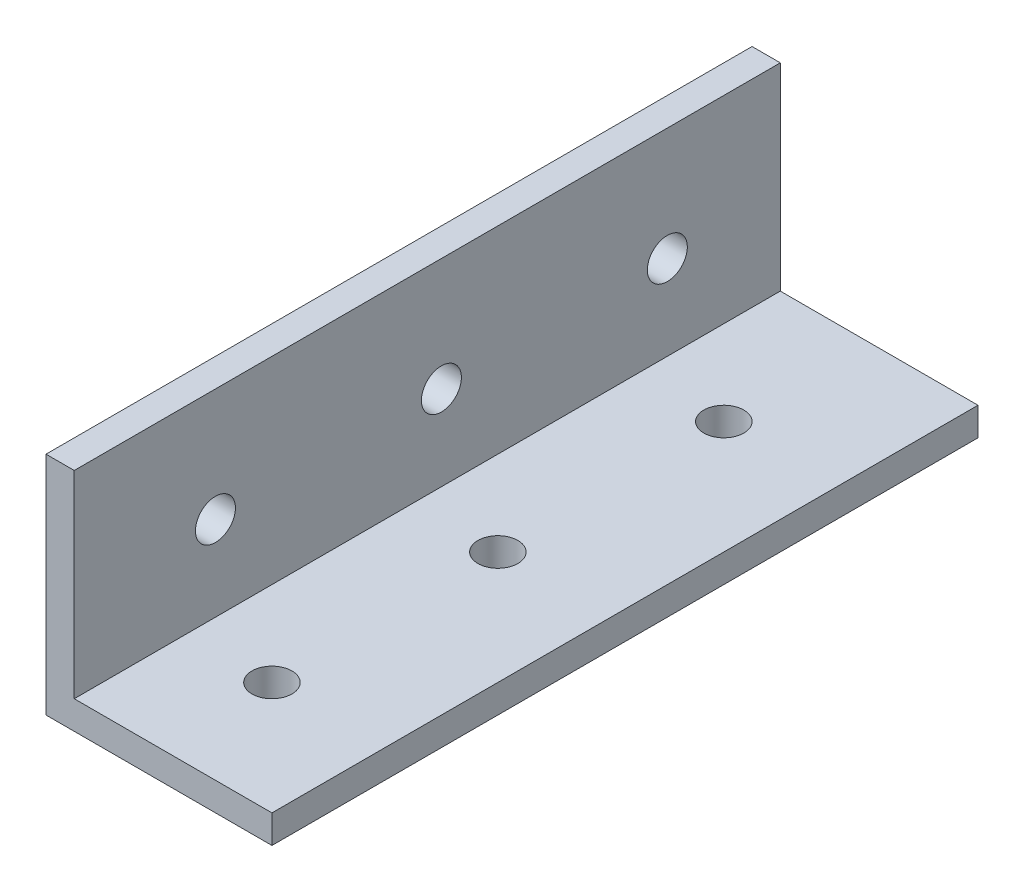
ISO-10303-21;
HEADER;
FILE_DESCRIPTION(('STEP AP214'),'2;1');
FILE_NAME('part.step','',(''),(''),'','','');
FILE_SCHEMA(('AUTOMOTIVE_DESIGN { 1 0 10303 214 1 1 1 1 }'));
ENDSEC;
DATA;
#1=APPLICATION_CONTEXT('core data for automotive mechanical design processes');
#2=APPLICATION_PROTOCOL_DEFINITION('international standard','automotive_design',2000,#1);
#3=PRODUCT_CONTEXT('',#1,'mechanical');
#4=PRODUCT('Part','Part','',(#3));
#5=PRODUCT_RELATED_PRODUCT_CATEGORY('part','',(#4));
#6=PRODUCT_DEFINITION_FORMATION('','',#4);
#7=PRODUCT_DEFINITION_CONTEXT('part definition',#1,'design');
#8=PRODUCT_DEFINITION('design','',#6,#7);
#9=PRODUCT_DEFINITION_SHAPE('','',#8);
#10=(LENGTH_UNIT() NAMED_UNIT(*) SI_UNIT(.MILLI.,.METRE.));
#11=(NAMED_UNIT(*) PLANE_ANGLE_UNIT() SI_UNIT($,.RADIAN.));
#12=(NAMED_UNIT(*) SI_UNIT($,.STERADIAN.) SOLID_ANGLE_UNIT());
#13=UNCERTAINTY_MEASURE_WITH_UNIT(LENGTH_MEASURE(1.E-05),#10,'distance_accuracy_value','');
#14=(GEOMETRIC_REPRESENTATION_CONTEXT(3) GLOBAL_UNCERTAINTY_ASSIGNED_CONTEXT((#13)) GLOBAL_UNIT_ASSIGNED_CONTEXT((#10,
#11,#12)) REPRESENTATION_CONTEXT('',''));
#15=CARTESIAN_POINT('',(0.,0.,0.));
#16=DIRECTION('',(0.,0.,1.));
#17=DIRECTION('',(1.,0.,0.));
#18=AXIS2_PLACEMENT_3D('',#15,#16,#17);
#19=CARTESIAN_POINT('',(0.,0.,79.375));
#20=DIRECTION('',(1.,0.,0.));
#21=DIRECTION('',(0.,0.,-1.));
#22=AXIS2_PLACEMENT_3D('',#19,#20,#21);
#23=PLANE('',#22);
#24=CARTESIAN_POINT('',(0.,12.7,63.5));
#25=DIRECTION('',(-1.,0.,0.));
#26=DIRECTION('',(0.,0.,1.));
#27=AXIS2_PLACEMENT_3D('',#24,#25,#26);
#28=CIRCLE('',#27,2.24789999999999);
#29=CARTESIAN_POINT('',(0.,12.7,65.7479));
#30=VERTEX_POINT('',#29);
#31=EDGE_CURVE('E186',#30,#30,#28,.T.);
#32=ORIENTED_EDGE('',*,*,#31,.F.);
#33=EDGE_LOOP('',(#32));
#34=FACE_BOUND('',#33,.T.);
#35=CARTESIAN_POINT('',(0.,12.7,38.1));
#36=DIRECTION('',(-1.,0.,0.));
#37=DIRECTION('',(0.,0.,1.));
#38=AXIS2_PLACEMENT_3D('',#35,#36,#37);
#39=CIRCLE('',#38,2.24789999999999);
#40=CARTESIAN_POINT('',(0.,12.7,40.3479));
#41=VERTEX_POINT('',#40);
#42=EDGE_CURVE('E190',#41,#41,#39,.T.);
#43=ORIENTED_EDGE('',*,*,#42,.F.);
#44=EDGE_LOOP('',(#43));
#45=FACE_BOUND('',#44,.T.);
#46=CARTESIAN_POINT('',(0.,12.7,12.7));
#47=DIRECTION('',(-1.,0.,0.));
#48=DIRECTION('',(0.,0.,1.));
#49=AXIS2_PLACEMENT_3D('',#46,#47,#48);
#50=CIRCLE('',#49,2.24789999999999);
#51=CARTESIAN_POINT('',(0.,12.7,14.9479));
#52=VERTEX_POINT('',#51);
#53=EDGE_CURVE('E193',#52,#52,#50,.T.);
#54=ORIENTED_EDGE('',*,*,#53,.F.);
#55=EDGE_LOOP('',(#54));
#56=FACE_BOUND('',#55,.T.);
#57=DIRECTION('',(0.,-1.,0.));
#58=VECTOR('',#57,1.);
#59=CARTESIAN_POINT('',(0.,0.,0.));
#60=LINE('',#59,#58);
#61=CARTESIAN_POINT('',(0.,25.4,0.));
#62=VERTEX_POINT('',#61);
#63=CARTESIAN_POINT('',(0.,0.,0.));
#64=VERTEX_POINT('',#63);
#65=EDGE_CURVE('E119',#62,#64,#60,.T.);
#66=ORIENTED_EDGE('',*,*,#65,.T.);
#67=DIRECTION('',(0.,0.,-1.));
#68=VECTOR('',#67,1.);
#69=CARTESIAN_POINT('',(0.,0.,79.375));
#70=LINE('',#69,#68);
#71=CARTESIAN_POINT('',(0.,0.,79.375));
#72=VERTEX_POINT('',#71);
#73=EDGE_CURVE('E11',#72,#64,#70,.T.);
#74=ORIENTED_EDGE('',*,*,#73,.F.);
#75=DIRECTION('',(0.,-1.,0.));
#76=VECTOR('',#75,1.);
#77=CARTESIAN_POINT('',(0.,0.,79.375));
#78=LINE('',#77,#76);
#79=CARTESIAN_POINT('',(0.,25.4,79.375));
#80=VERTEX_POINT('',#79);
#81=EDGE_CURVE('E130',#80,#72,#78,.T.);
#82=ORIENTED_EDGE('',*,*,#81,.F.);
#83=DIRECTION('',(0.,0.,-1.));
#84=VECTOR('',#83,1.);
#85=CARTESIAN_POINT('',(0.,25.4,79.375));
#86=LINE('',#85,#84);
#87=EDGE_CURVE('E115',#80,#62,#86,.T.);
#88=ORIENTED_EDGE('',*,*,#87,.T.);
#89=EDGE_LOOP('',(#66,#74,#82,#88));
#90=FACE_BOUND('',#89,.T.);
#91=ADVANCED_FACE('F33',(#34,#45,#56,#90),#23,.F.);
#92=CARTESIAN_POINT('',(0.,0.,79.375));
#93=DIRECTION('',(0.,1.,0.));
#94=DIRECTION('',(0.,0.,1.));
#95=AXIS2_PLACEMENT_3D('',#92,#93,#94);
#96=PLANE('',#95);
#97=CARTESIAN_POINT('',(12.7,0.,66.675));
#98=DIRECTION('',(0.,-1.,0.));
#99=DIRECTION('',(0.,0.,-1.));
#100=AXIS2_PLACEMENT_3D('',#97,#98,#99);
#101=CIRCLE('',#100,2.24789999999999);
#102=CARTESIAN_POINT('',(12.7,0.,64.4271));
#103=VERTEX_POINT('',#102);
#104=EDGE_CURVE('E149',#103,#103,#101,.T.);
#105=ORIENTED_EDGE('',*,*,#104,.F.);
#106=EDGE_LOOP('',(#105));
#107=FACE_BOUND('',#106,.T.);
#108=CARTESIAN_POINT('',(12.7,0.,41.275));
#109=DIRECTION('',(0.,-1.,0.));
#110=DIRECTION('',(0.,0.,-1.));
#111=AXIS2_PLACEMENT_3D('',#108,#109,#110);
#112=CIRCLE('',#111,2.24789999999999);
#113=CARTESIAN_POINT('',(12.7,0.,39.0271));
#114=VERTEX_POINT('',#113);
#115=EDGE_CURVE('E138',#114,#114,#112,.T.);
#116=ORIENTED_EDGE('',*,*,#115,.F.);
#117=EDGE_LOOP('',(#116));
#118=FACE_BOUND('',#117,.T.);
#119=CARTESIAN_POINT('',(12.7,0.,15.875));
#120=DIRECTION('',(0.,-1.,0.));
#121=DIRECTION('',(0.,0.,-1.));
#122=AXIS2_PLACEMENT_3D('',#119,#120,#121);
#123=CIRCLE('',#122,2.24789999999999);
#124=CARTESIAN_POINT('',(12.7,0.,13.6271));
#125=VERTEX_POINT('',#124);
#126=EDGE_CURVE('E137',#125,#125,#123,.T.);
#127=ORIENTED_EDGE('',*,*,#126,.F.);
#128=EDGE_LOOP('',(#127));
#129=FACE_BOUND('',#128,.T.);
#130=DIRECTION('',(1.,0.,0.));
#131=VECTOR('',#130,1.);
#132=CARTESIAN_POINT('',(0.,0.,0.));
#133=LINE('',#132,#131);
#134=CARTESIAN_POINT('',(25.4,0.,0.));
#135=VERTEX_POINT('',#134);
#136=EDGE_CURVE('E122',#64,#135,#133,.T.);
#137=ORIENTED_EDGE('',*,*,#136,.T.);
#138=DIRECTION('',(0.,0.,-1.));
#139=VECTOR('',#138,1.);
#140=CARTESIAN_POINT('',(25.4,0.,79.375));
#141=LINE('',#140,#139);
#142=CARTESIAN_POINT('',(25.4,0.,79.375));
#143=VERTEX_POINT('',#142);
#144=EDGE_CURVE('E42',#143,#135,#141,.T.);
#145=ORIENTED_EDGE('',*,*,#144,.F.);
#146=DIRECTION('',(1.,0.,0.));
#147=VECTOR('',#146,1.);
#148=CARTESIAN_POINT('',(0.,0.,79.375));
#149=LINE('',#148,#147);
#150=EDGE_CURVE('E88',#72,#143,#149,.T.);
#151=ORIENTED_EDGE('',*,*,#150,.F.);
#152=ORIENTED_EDGE('',*,*,#73,.T.);
#153=EDGE_LOOP('',(#137,#145,#151,#152));
#154=FACE_BOUND('',#153,.T.);
#155=ADVANCED_FACE('F158',(#107,#118,#129,#154),#96,.F.);
#156=CARTESIAN_POINT('',(25.4,0.,79.375));
#157=DIRECTION('',(-1.,0.,0.));
#158=DIRECTION('',(0.,0.,1.));
#159=AXIS2_PLACEMENT_3D('',#156,#157,#158);
#160=PLANE('',#159);
#161=DIRECTION('',(0.,1.,0.));
#162=VECTOR('',#161,1.);
#163=CARTESIAN_POINT('',(25.4,0.,0.));
#164=LINE('',#163,#162);
#165=CARTESIAN_POINT('',(25.4,3.175,0.));
#166=VERTEX_POINT('',#165);
#167=EDGE_CURVE('E125',#135,#166,#164,.T.);
#168=ORIENTED_EDGE('',*,*,#167,.T.);
#169=DIRECTION('',(0.,0.,-1.));
#170=VECTOR('',#169,1.);
#171=CARTESIAN_POINT('',(25.4,3.175,79.375));
#172=LINE('',#171,#170);
#173=CARTESIAN_POINT('',(25.4,3.175,79.375));
#174=VERTEX_POINT('',#173);
#175=EDGE_CURVE('E110',#174,#166,#172,.T.);
#176=ORIENTED_EDGE('',*,*,#175,.F.);
#177=DIRECTION('',(0.,1.,0.));
#178=VECTOR('',#177,1.);
#179=CARTESIAN_POINT('',(25.4,0.,79.375));
#180=LINE('',#179,#178);
#181=EDGE_CURVE('E101',#143,#174,#180,.T.);
#182=ORIENTED_EDGE('',*,*,#181,.F.);
#183=ORIENTED_EDGE('',*,*,#144,.T.);
#184=EDGE_LOOP('',(#168,#176,#182,#183));
#185=FACE_BOUND('',#184,.T.);
#186=ADVANCED_FACE('F161',(#185),#160,.F.);
#187=CARTESIAN_POINT('',(25.4,3.175,79.375));
#188=DIRECTION('',(0.,-1.,0.));
#189=DIRECTION('',(1.,0.,0.));
#190=AXIS2_PLACEMENT_3D('',#187,#188,#189);
#191=PLANE('',#190);
#192=CARTESIAN_POINT('',(12.7,3.175,66.675));
#193=DIRECTION('',(0.,-1.,0.));
#194=DIRECTION('',(1.,0.,0.));
#195=AXIS2_PLACEMENT_3D('',#192,#193,#194);
#196=CIRCLE('',#195,2.24789999999999);
#197=CARTESIAN_POINT('',(14.9479,3.175,66.675));
#198=VERTEX_POINT('',#197);
#199=EDGE_CURVE('E144',#198,#198,#196,.T.);
#200=ORIENTED_EDGE('',*,*,#199,.T.);
#201=EDGE_LOOP('',(#200));
#202=FACE_BOUND('',#201,.T.);
#203=CARTESIAN_POINT('',(12.7,3.175,41.275));
#204=DIRECTION('',(0.,-1.,0.));
#205=DIRECTION('',(1.,0.,0.));
#206=AXIS2_PLACEMENT_3D('',#203,#204,#205);
#207=CIRCLE('',#206,2.24789999999999);
#208=CARTESIAN_POINT('',(14.9479,3.175,41.275));
#209=VERTEX_POINT('',#208);
#210=EDGE_CURVE('E135',#209,#209,#207,.T.);
#211=ORIENTED_EDGE('',*,*,#210,.T.);
#212=EDGE_LOOP('',(#211));
#213=FACE_BOUND('',#212,.T.);
#214=CARTESIAN_POINT('',(12.7,3.175,15.875));
#215=DIRECTION('',(0.,-1.,0.));
#216=DIRECTION('',(1.,0.,0.));
#217=AXIS2_PLACEMENT_3D('',#214,#215,#216);
#218=CIRCLE('',#217,2.24789999999999);
#219=CARTESIAN_POINT('',(14.9479,3.175,15.875));
#220=VERTEX_POINT('',#219);
#221=EDGE_CURVE('E123',#220,#220,#218,.T.);
#222=ORIENTED_EDGE('',*,*,#221,.T.);
#223=EDGE_LOOP('',(#222));
#224=FACE_BOUND('',#223,.T.);
#225=DIRECTION('',(-1.,0.,0.));
#226=VECTOR('',#225,1.);
#227=CARTESIAN_POINT('',(25.4,3.175,0.));
#228=LINE('',#227,#226);
#229=CARTESIAN_POINT('',(3.175,3.175,0.));
#230=VERTEX_POINT('',#229);
#231=EDGE_CURVE('E109',#166,#230,#228,.T.);
#232=ORIENTED_EDGE('',*,*,#231,.T.);
#233=DIRECTION('',(0.,0.,-1.));
#234=VECTOR('',#233,1.);
#235=CARTESIAN_POINT('',(3.175,3.175,79.375));
#236=LINE('',#235,#234);
#237=CARTESIAN_POINT('',(3.175,3.175,79.375));
#238=VERTEX_POINT('',#237);
#239=EDGE_CURVE('E106',#238,#230,#236,.T.);
#240=ORIENTED_EDGE('',*,*,#239,.F.);
#241=DIRECTION('',(-1.,0.,0.));
#242=VECTOR('',#241,1.);
#243=CARTESIAN_POINT('',(25.4,3.175,79.375));
#244=LINE('',#243,#242);
#245=EDGE_CURVE('E95',#174,#238,#244,.T.);
#246=ORIENTED_EDGE('',*,*,#245,.F.);
#247=ORIENTED_EDGE('',*,*,#175,.T.);
#248=EDGE_LOOP('',(#232,#240,#246,#247));
#249=FACE_BOUND('',#248,.T.);
#250=ADVANCED_FACE('F107',(#202,#213,#224,#249),#191,.F.);
#251=CARTESIAN_POINT('',(3.175,25.4,79.375));
#252=DIRECTION('',(-1.,0.,0.));
#253=DIRECTION('',(0.,-1.,0.));
#254=AXIS2_PLACEMENT_3D('',#251,#252,#253);
#255=PLANE('',#254);
#256=CARTESIAN_POINT('',(3.175,12.7,63.5));
#257=DIRECTION('',(-1.,0.,0.));
#258=DIRECTION('',(0.,-1.,0.));
#259=AXIS2_PLACEMENT_3D('',#256,#257,#258);
#260=CIRCLE('',#259,2.24789999999999);
#261=CARTESIAN_POINT('',(3.175,10.4521,63.5));
#262=VERTEX_POINT('',#261);
#263=EDGE_CURVE('E299',#262,#262,#260,.T.);
#264=ORIENTED_EDGE('',*,*,#263,.T.);
#265=EDGE_LOOP('',(#264));
#266=FACE_BOUND('',#265,.T.);
#267=CARTESIAN_POINT('',(3.175,12.7,38.1));
#268=DIRECTION('',(-1.,0.,0.));
#269=DIRECTION('',(0.,-1.,0.));
#270=AXIS2_PLACEMENT_3D('',#267,#268,#269);
#271=CIRCLE('',#270,2.24789999999999);
#272=CARTESIAN_POINT('',(3.175,10.4521,38.1));
#273=VERTEX_POINT('',#272);
#274=EDGE_CURVE('E36',#273,#273,#271,.T.);
#275=ORIENTED_EDGE('',*,*,#274,.T.);
#276=EDGE_LOOP('',(#275));
#277=FACE_BOUND('',#276,.T.);
#278=CARTESIAN_POINT('',(3.175,12.7,12.7));
#279=DIRECTION('',(-1.,0.,0.));
#280=DIRECTION('',(0.,-1.,0.));
#281=AXIS2_PLACEMENT_3D('',#278,#279,#280);
#282=CIRCLE('',#281,2.24789999999999);
#283=CARTESIAN_POINT('',(3.175,10.4521,12.7));
#284=VERTEX_POINT('',#283);
#285=EDGE_CURVE('E195',#284,#284,#282,.T.);
#286=ORIENTED_EDGE('',*,*,#285,.T.);
#287=EDGE_LOOP('',(#286));
#288=FACE_BOUND('',#287,.T.);
#289=DIRECTION('',(0.,1.,0.));
#290=VECTOR('',#289,1.);
#291=CARTESIAN_POINT('',(3.175,25.4,0.));
#292=LINE('',#291,#290);
#293=CARTESIAN_POINT('',(3.175,25.4,0.));
#294=VERTEX_POINT('',#293);
#295=EDGE_CURVE('E74',#230,#294,#292,.T.);
#296=ORIENTED_EDGE('',*,*,#295,.T.);
#297=DIRECTION('',(0.,0.,-1.));
#298=VECTOR('',#297,1.);
#299=CARTESIAN_POINT('',(3.175,25.4,79.375));
#300=LINE('',#299,#298);
#301=CARTESIAN_POINT('',(3.175,25.4,79.375));
#302=VERTEX_POINT('',#301);
#303=EDGE_CURVE('E111',#302,#294,#300,.T.);
#304=ORIENTED_EDGE('',*,*,#303,.F.);
#305=DIRECTION('',(0.,1.,0.));
#306=VECTOR('',#305,1.);
#307=CARTESIAN_POINT('',(3.175,25.4,79.375));
#308=LINE('',#307,#306);
#309=EDGE_CURVE('E99',#238,#302,#308,.T.);
#310=ORIENTED_EDGE('',*,*,#309,.F.);
#311=ORIENTED_EDGE('',*,*,#239,.T.);
#312=EDGE_LOOP('',(#296,#304,#310,#311));
#313=FACE_BOUND('',#312,.T.);
#314=ADVANCED_FACE('F113',(#266,#277,#288,#313),#255,.F.);
#315=CARTESIAN_POINT('',(0.,25.4,79.375));
#316=DIRECTION('',(0.,-1.,0.));
#317=DIRECTION('',(0.,0.,-1.));
#318=AXIS2_PLACEMENT_3D('',#315,#316,#317);
#319=PLANE('',#318);
#320=DIRECTION('',(-1.,0.,0.));
#321=VECTOR('',#320,1.);
#322=CARTESIAN_POINT('',(0.,25.4,0.));
#323=LINE('',#322,#321);
#324=EDGE_CURVE('E80',#294,#62,#323,.T.);
#325=ORIENTED_EDGE('',*,*,#324,.T.);
#326=ORIENTED_EDGE('',*,*,#87,.F.);
#327=DIRECTION('',(-1.,0.,0.));
#328=VECTOR('',#327,1.);
#329=CARTESIAN_POINT('',(0.,25.4,79.375));
#330=LINE('',#329,#328);
#331=EDGE_CURVE('E51',#302,#80,#330,.T.);
#332=ORIENTED_EDGE('',*,*,#331,.F.);
#333=ORIENTED_EDGE('',*,*,#303,.T.);
#334=EDGE_LOOP('',(#325,#326,#332,#333));
#335=FACE_BOUND('',#334,.T.);
#336=ADVANCED_FACE('F166',(#335),#319,.F.);
#337=CARTESIAN_POINT('',(0.,0.,79.375));
#338=DIRECTION('',(0.,0.,-1.));
#339=DIRECTION('',(-1.,0.,0.));
#340=AXIS2_PLACEMENT_3D('',#337,#338,#339);
#341=PLANE('',#340);
#342=ORIENTED_EDGE('',*,*,#81,.T.);
#343=ORIENTED_EDGE('',*,*,#150,.T.);
#344=ORIENTED_EDGE('',*,*,#181,.T.);
#345=ORIENTED_EDGE('',*,*,#245,.T.);
#346=ORIENTED_EDGE('',*,*,#309,.T.);
#347=ORIENTED_EDGE('',*,*,#331,.T.);
#348=EDGE_LOOP('',(#342,#343,#344,#345,#346,#347));
#349=FACE_BOUND('',#348,.T.);
#350=ADVANCED_FACE('F97',(#349),#341,.F.);
#351=CARTESIAN_POINT('',(0.,0.,0.));
#352=DIRECTION('',(0.,0.,-1.));
#353=DIRECTION('',(-1.,0.,0.));
#354=AXIS2_PLACEMENT_3D('',#351,#352,#353);
#355=PLANE('',#354);
#356=ORIENTED_EDGE('',*,*,#65,.F.);
#357=ORIENTED_EDGE('',*,*,#324,.F.);
#358=ORIENTED_EDGE('',*,*,#295,.F.);
#359=ORIENTED_EDGE('',*,*,#231,.F.);
#360=ORIENTED_EDGE('',*,*,#167,.F.);
#361=ORIENTED_EDGE('',*,*,#136,.F.);
#362=EDGE_LOOP('',(#356,#357,#358,#359,#360,#361));
#363=FACE_BOUND('',#362,.T.);
#364=ADVANCED_FACE('F164',(#363),#355,.T.);
#365=CARTESIAN_POINT('',(12.7,0.,15.875));
#366=DIRECTION('',(0.,-1.,0.));
#367=DIRECTION('',(0.,0.,-1.));
#368=AXIS2_PLACEMENT_3D('',#365,#366,#367);
#369=CYLINDRICAL_SURFACE('',#368,2.24789999999999);
#370=ORIENTED_EDGE('',*,*,#126,.T.);
#371=EDGE_LOOP('',(#370));
#372=FACE_BOUND('',#371,.T.);
#373=ORIENTED_EDGE('',*,*,#221,.F.);
#374=EDGE_LOOP('',(#373));
#375=FACE_BOUND('',#374,.T.);
#376=ADVANCED_FACE('F211',(#372,#375),#369,.F.);
#377=CARTESIAN_POINT('',(12.7,0.,41.275));
#378=DIRECTION('',(0.,-1.,0.));
#379=DIRECTION('',(0.,0.,-1.));
#380=AXIS2_PLACEMENT_3D('',#377,#378,#379);
#381=CYLINDRICAL_SURFACE('',#380,2.24789999999999);
#382=ORIENTED_EDGE('',*,*,#115,.T.);
#383=EDGE_LOOP('',(#382));
#384=FACE_BOUND('',#383,.T.);
#385=ORIENTED_EDGE('',*,*,#210,.F.);
#386=EDGE_LOOP('',(#385));
#387=FACE_BOUND('',#386,.T.);
#388=ADVANCED_FACE('F214',(#384,#387),#381,.F.);
#389=CARTESIAN_POINT('',(12.7,0.,66.675));
#390=DIRECTION('',(0.,-1.,0.));
#391=DIRECTION('',(0.,0.,-1.));
#392=AXIS2_PLACEMENT_3D('',#389,#390,#391);
#393=CYLINDRICAL_SURFACE('',#392,2.24789999999999);
#394=ORIENTED_EDGE('',*,*,#104,.T.);
#395=EDGE_LOOP('',(#394));
#396=FACE_BOUND('',#395,.T.);
#397=ORIENTED_EDGE('',*,*,#199,.F.);
#398=EDGE_LOOP('',(#397));
#399=FACE_BOUND('',#398,.T.);
#400=ADVANCED_FACE('F205',(#396,#399),#393,.F.);
#401=CARTESIAN_POINT('',(0.,12.7,12.7));
#402=DIRECTION('',(-1.,0.,0.));
#403=DIRECTION('',(0.,0.,1.));
#404=AXIS2_PLACEMENT_3D('',#401,#402,#403);
#405=CYLINDRICAL_SURFACE('',#404,2.24789999999999);
#406=ORIENTED_EDGE('',*,*,#53,.T.);
#407=EDGE_LOOP('',(#406));
#408=FACE_BOUND('',#407,.T.);
#409=ORIENTED_EDGE('',*,*,#285,.F.);
#410=EDGE_LOOP('',(#409));
#411=FACE_BOUND('',#410,.T.);
#412=ADVANCED_FACE('F227',(#408,#411),#405,.F.);
#413=CARTESIAN_POINT('',(0.,12.7,38.1));
#414=DIRECTION('',(-1.,0.,0.));
#415=DIRECTION('',(0.,0.,1.));
#416=AXIS2_PLACEMENT_3D('',#413,#414,#415);
#417=CYLINDRICAL_SURFACE('',#416,2.24789999999999);
#418=ORIENTED_EDGE('',*,*,#42,.T.);
#419=EDGE_LOOP('',(#418));
#420=FACE_BOUND('',#419,.T.);
#421=ORIENTED_EDGE('',*,*,#274,.F.);
#422=EDGE_LOOP('',(#421));
#423=FACE_BOUND('',#422,.T.);
#424=ADVANCED_FACE('F233',(#420,#423),#417,.F.);
#425=CARTESIAN_POINT('',(0.,12.7,63.5));
#426=DIRECTION('',(-1.,0.,0.));
#427=DIRECTION('',(0.,0.,1.));
#428=AXIS2_PLACEMENT_3D('',#425,#426,#427);
#429=CYLINDRICAL_SURFACE('',#428,2.24789999999999);
#430=ORIENTED_EDGE('',*,*,#31,.T.);
#431=EDGE_LOOP('',(#430));
#432=FACE_BOUND('',#431,.T.);
#433=ORIENTED_EDGE('',*,*,#263,.F.);
#434=EDGE_LOOP('',(#433));
#435=FACE_BOUND('',#434,.T.);
#436=ADVANCED_FACE('F283',(#432,#435),#429,.F.);
#437=CLOSED_SHELL('',(#91,#155,#186,#250,#314,#336,#350,#364,#376,#388,#400,#412,#424,#436));
#438=MANIFOLD_SOLID_BREP('B2',#437);
#439=ADVANCED_BREP_SHAPE_REPRESENTATION('',(#18,#438),#14);
#440=SHAPE_DEFINITION_REPRESENTATION(#9,#439);
ENDSEC;
END-ISO-10303-21;
